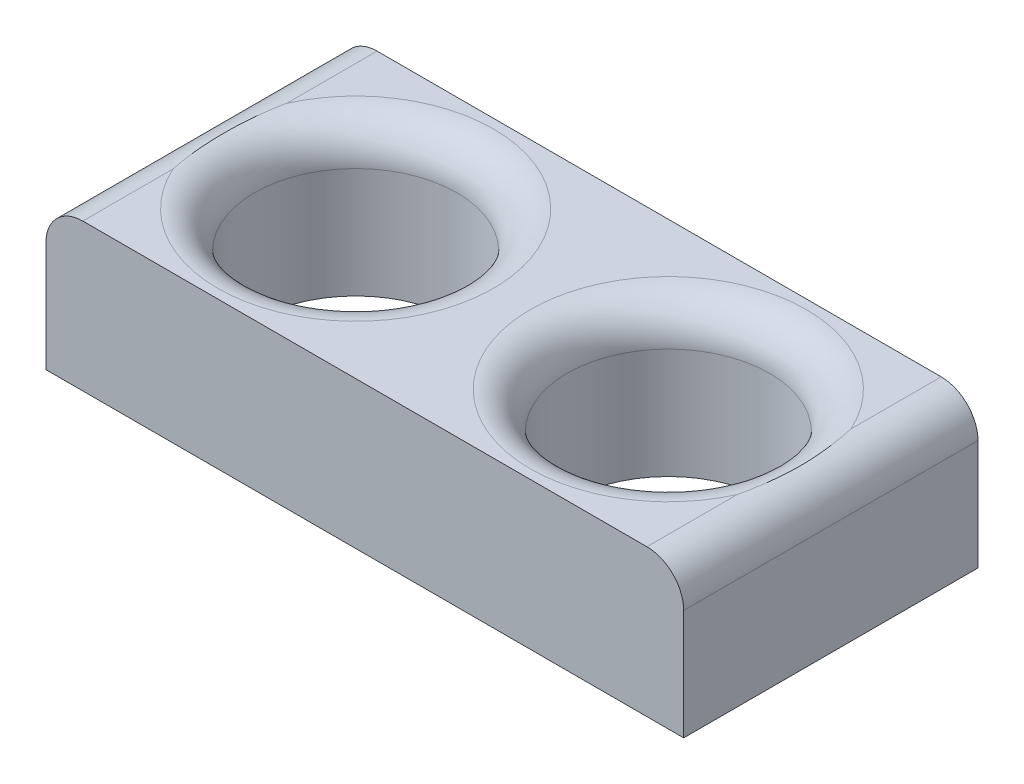
ISO-10303-21;
HEADER;
FILE_DESCRIPTION(('STEP AP214'),'2;1');
FILE_NAME('part.step','',(''),(''),'','','');
FILE_SCHEMA(('AUTOMOTIVE_DESIGN { 1 0 10303 214 1 1 1 1 }'));
ENDSEC;
DATA;
#1=APPLICATION_CONTEXT('core data for automotive mechanical design processes');
#2=APPLICATION_PROTOCOL_DEFINITION('international standard','automotive_design',2000,#1);
#3=PRODUCT_CONTEXT('',#1,'mechanical');
#4=PRODUCT('Part','Part','',(#3));
#5=PRODUCT_RELATED_PRODUCT_CATEGORY('part','',(#4));
#6=PRODUCT_DEFINITION_FORMATION('','',#4);
#7=PRODUCT_DEFINITION_CONTEXT('part definition',#1,'design');
#8=PRODUCT_DEFINITION('design','',#6,#7);
#9=PRODUCT_DEFINITION_SHAPE('','',#8);
#10=(LENGTH_UNIT() NAMED_UNIT(*) SI_UNIT(.MILLI.,.METRE.));
#11=(NAMED_UNIT(*) PLANE_ANGLE_UNIT() SI_UNIT($,.RADIAN.));
#12=(NAMED_UNIT(*) SI_UNIT($,.STERADIAN.) SOLID_ANGLE_UNIT());
#13=UNCERTAINTY_MEASURE_WITH_UNIT(LENGTH_MEASURE(1.E-05),#10,'distance_accuracy_value','');
#14=(GEOMETRIC_REPRESENTATION_CONTEXT(3) GLOBAL_UNCERTAINTY_ASSIGNED_CONTEXT((#13)) GLOBAL_UNIT_ASSIGNED_CONTEXT((#10,
#11,#12)) REPRESENTATION_CONTEXT('',''));
#15=CARTESIAN_POINT('',(0.,0.,0.));
#16=DIRECTION('',(0.,0.,1.));
#17=DIRECTION('',(1.,0.,0.));
#18=AXIS2_PLACEMENT_3D('',#15,#16,#17);
#19=CARTESIAN_POINT('',(26.,12.,-12.));
#20=DIRECTION('',(-1.,0.,0.));
#21=DIRECTION('',(0.,0.,1.));
#22=AXIS2_PLACEMENT_3D('',#19,#20,#21);
#23=PLANE('',#22);
#24=DIRECTION('',(0.,-1.,0.));
#25=VECTOR('',#24,1.);
#26=CARTESIAN_POINT('',(26.,12.,-12.));
#27=LINE('',#26,#25);
#28=CARTESIAN_POINT('',(26.,9.,-12.));
#29=VERTEX_POINT('',#28);
#30=CARTESIAN_POINT('',(26.,0.,-12.));
#31=VERTEX_POINT('',#30);
#32=EDGE_CURVE('E182',#29,#31,#27,.T.);
#33=ORIENTED_EDGE('',*,*,#32,.F.);
#34=DIRECTION('',(0.,0.,-1.));
#35=VECTOR('',#34,1.);
#36=CARTESIAN_POINT('',(26.,9.,12.));
#37=LINE('',#36,#35);
#38=CARTESIAN_POINT('',(26.,9.,12.));
#39=VERTEX_POINT('',#38);
#40=EDGE_CURVE('E68',#29,#39,#37,.F.);
#41=ORIENTED_EDGE('',*,*,#40,.T.);
#42=DIRECTION('',(0.,-1.,0.));
#43=VECTOR('',#42,1.);
#44=CARTESIAN_POINT('',(26.,12.,12.));
#45=LINE('',#44,#43);
#46=CARTESIAN_POINT('',(26.,0.,12.));
#47=VERTEX_POINT('',#46);
#48=EDGE_CURVE('E204',#39,#47,#45,.T.);
#49=ORIENTED_EDGE('',*,*,#48,.T.);
#50=DIRECTION('',(0.,0.,-1.));
#51=VECTOR('',#50,1.);
#52=CARTESIAN_POINT('',(26.,0.,-12.));
#53=LINE('',#52,#51);
#54=EDGE_CURVE('E199',#47,#31,#53,.T.);
#55=ORIENTED_EDGE('',*,*,#54,.T.);
#56=EDGE_LOOP('',(#33,#41,#49,#55));
#57=FACE_BOUND('',#56,.T.);
#58=ADVANCED_FACE('F38',(#57),#23,.F.);
#59=CARTESIAN_POINT('',(-26.,12.,-12.));
#60=DIRECTION('',(1.,0.,0.));
#61=DIRECTION('',(0.,0.,-1.));
#62=AXIS2_PLACEMENT_3D('',#59,#60,#61);
#63=PLANE('',#62);
#64=DIRECTION('',(0.,-1.,0.));
#65=VECTOR('',#64,1.);
#66=CARTESIAN_POINT('',(-26.,12.,12.));
#67=LINE('',#66,#65);
#68=CARTESIAN_POINT('',(-26.,9.,12.));
#69=VERTEX_POINT('',#68);
#70=CARTESIAN_POINT('',(-26.,0.,12.));
#71=VERTEX_POINT('',#70);
#72=EDGE_CURVE('E222',#69,#71,#67,.T.);
#73=ORIENTED_EDGE('',*,*,#72,.F.);
#74=DIRECTION('',(0.,0.,1.));
#75=VECTOR('',#74,1.);
#76=CARTESIAN_POINT('',(-26.,9.,-12.));
#77=LINE('',#76,#75);
#78=CARTESIAN_POINT('',(-26.,9.,-12.));
#79=VERTEX_POINT('',#78);
#80=EDGE_CURVE('E11',#69,#79,#77,.F.);
#81=ORIENTED_EDGE('',*,*,#80,.T.);
#82=DIRECTION('',(0.,-1.,0.));
#83=VECTOR('',#82,1.);
#84=CARTESIAN_POINT('',(-26.,12.,-12.));
#85=LINE('',#84,#83);
#86=CARTESIAN_POINT('',(-26.,0.,-12.));
#87=VERTEX_POINT('',#86);
#88=EDGE_CURVE('E192',#79,#87,#85,.T.);
#89=ORIENTED_EDGE('',*,*,#88,.T.);
#90=DIRECTION('',(0.,0.,1.));
#91=VECTOR('',#90,1.);
#92=CARTESIAN_POINT('',(-26.,0.,-12.));
#93=LINE('',#92,#91);
#94=EDGE_CURVE('E201',#87,#71,#93,.T.);
#95=ORIENTED_EDGE('',*,*,#94,.T.);
#96=EDGE_LOOP('',(#73,#81,#89,#95));
#97=FACE_BOUND('',#96,.T.);
#98=ADVANCED_FACE('F366',(#97),#63,.F.);
#99=CARTESIAN_POINT('',(0.,0.,0.));
#100=DIRECTION('',(0.,1.,0.));
#101=DIRECTION('',(0.,0.,1.));
#102=AXIS2_PLACEMENT_3D('',#99,#100,#101);
#103=PLANE('',#102);
#104=CARTESIAN_POINT('',(-12.75,0.,0.));
#105=DIRECTION('',(0.,1.,0.));
#106=DIRECTION('',(0.,0.,1.));
#107=AXIS2_PLACEMENT_3D('',#104,#105,#106);
#108=CIRCLE('',#107,8.25);
#109=CARTESIAN_POINT('',(-12.75,0.,8.25));
#110=VERTEX_POINT('',#109);
#111=EDGE_CURVE('E210',#110,#110,#108,.T.);
#112=ORIENTED_EDGE('',*,*,#111,.T.);
#113=EDGE_LOOP('',(#112));
#114=FACE_BOUND('',#113,.T.);
#115=CARTESIAN_POINT('',(12.75,0.,0.));
#116=DIRECTION('',(0.,1.,0.));
#117=DIRECTION('',(0.,0.,1.));
#118=AXIS2_PLACEMENT_3D('',#115,#116,#117);
#119=CIRCLE('',#118,8.25);
#120=CARTESIAN_POINT('',(12.75,0.,8.24999999999999));
#121=VERTEX_POINT('',#120);
#122=EDGE_CURVE('E206',#121,#121,#119,.T.);
#123=ORIENTED_EDGE('',*,*,#122,.T.);
#124=EDGE_LOOP('',(#123));
#125=FACE_BOUND('',#124,.T.);
#126=DIRECTION('',(0.,0.,1.));
#127=VECTOR('',#126,1.);
#128=CARTESIAN_POINT('',(6.,0.,0.));
#129=LINE('',#128,#127);
#130=CARTESIAN_POINT('',(6.,0.,-11.5));
#131=VERTEX_POINT('',#130);
#132=CARTESIAN_POINT('',(6.,0.,-5.5));
#133=VERTEX_POINT('',#132);
#134=EDGE_CURVE('E308',#131,#133,#129,.T.);
#135=ORIENTED_EDGE('',*,*,#134,.F.);
#136=CARTESIAN_POINT('',(6.5,0.,-11.5));
#137=DIRECTION('',(0.,1.,0.));
#138=DIRECTION('',(0.,0.,1.));
#139=AXIS2_PLACEMENT_3D('',#136,#137,#138);
#140=CIRCLE('',#139,0.5);
#141=CARTESIAN_POINT('',(6.5,0.,-12.));
#142=VERTEX_POINT('',#141);
#143=EDGE_CURVE('E200',#131,#142,#140,.F.);
#144=ORIENTED_EDGE('',*,*,#143,.T.);
#145=DIRECTION('',(-1.,0.,0.));
#146=VECTOR('',#145,1.);
#147=CARTESIAN_POINT('',(-26.,0.,-12.));
#148=LINE('',#147,#146);
#149=EDGE_CURVE('E186',#31,#142,#148,.T.);
#150=ORIENTED_EDGE('',*,*,#149,.F.);
#151=ORIENTED_EDGE('',*,*,#54,.F.);
#152=DIRECTION('',(1.,0.,0.));
#153=VECTOR('',#152,1.);
#154=CARTESIAN_POINT('',(-26.,0.,12.));
#155=LINE('',#154,#153);
#156=EDGE_CURVE('E218',#71,#47,#155,.T.);
#157=ORIENTED_EDGE('',*,*,#156,.F.);
#158=ORIENTED_EDGE('',*,*,#94,.F.);
#159=CARTESIAN_POINT('',(-6.5,0.,-12.));
#160=VERTEX_POINT('',#159);
#161=EDGE_CURVE('E202',#160,#87,#148,.T.);
#162=ORIENTED_EDGE('',*,*,#161,.F.);
#163=CARTESIAN_POINT('',(-6.5,0.,-11.5));
#164=DIRECTION('',(0.,1.,0.));
#165=DIRECTION('',(0.,0.,1.));
#166=AXIS2_PLACEMENT_3D('',#163,#164,#165);
#167=CIRCLE('',#166,0.5);
#168=CARTESIAN_POINT('',(-6.,0.,-11.5));
#169=VERTEX_POINT('',#168);
#170=EDGE_CURVE('E231',#160,#169,#167,.F.);
#171=ORIENTED_EDGE('',*,*,#170,.T.);
#172=DIRECTION('',(0.,0.,1.));
#173=VECTOR('',#172,1.);
#174=CARTESIAN_POINT('',(-6.,0.,0.));
#175=LINE('',#174,#173);
#176=CARTESIAN_POINT('',(-6.,0.,-5.5));
#177=VERTEX_POINT('',#176);
#178=EDGE_CURVE('E451',#169,#177,#175,.T.);
#179=ORIENTED_EDGE('',*,*,#178,.T.);
#180=CARTESIAN_POINT('',(-5.5,0.,-5.5));
#181=DIRECTION('',(0.,1.,0.));
#182=DIRECTION('',(0.,0.,1.));
#183=AXIS2_PLACEMENT_3D('',#180,#181,#182);
#184=CIRCLE('',#183,0.5);
#185=CARTESIAN_POINT('',(-5.5,0.,-5.));
#186=VERTEX_POINT('',#185);
#187=EDGE_CURVE('E269',#177,#186,#184,.T.);
#188=ORIENTED_EDGE('',*,*,#187,.T.);
#189=DIRECTION('',(1.,0.,0.));
#190=VECTOR('',#189,1.);
#191=CARTESIAN_POINT('',(0.,0.,-5.));
#192=LINE('',#191,#190);
#193=CARTESIAN_POINT('',(5.5,0.,-5.));
#194=VERTEX_POINT('',#193);
#195=EDGE_CURVE('E447',#186,#194,#192,.T.);
#196=ORIENTED_EDGE('',*,*,#195,.T.);
#197=CARTESIAN_POINT('',(5.5,0.,-5.5));
#198=DIRECTION('',(0.,1.,0.));
#199=DIRECTION('',(0.,0.,1.));
#200=AXIS2_PLACEMENT_3D('',#197,#198,#199);
#201=CIRCLE('',#200,0.5);
#202=EDGE_CURVE('E267',#194,#133,#201,.T.);
#203=ORIENTED_EDGE('',*,*,#202,.T.);
#204=EDGE_LOOP('',(#135,#144,#150,#151,#157,#158,#162,#171,#179,#188,#196,#203));
#205=FACE_BOUND('',#204,.T.);
#206=ADVANCED_FACE('F197',(#114,#125,#205),#103,.F.);
#207=CARTESIAN_POINT('',(-26.,12.,-12.));
#208=DIRECTION('',(0.,0.,1.));
#209=DIRECTION('',(1.,0.,0.));
#210=AXIS2_PLACEMENT_3D('',#207,#208,#209);
#211=PLANE('',#210);
#212=DIRECTION('',(-1.,0.,0.));
#213=VECTOR('',#212,1.);
#214=CARTESIAN_POINT('',(-26.,12.,-12.));
#215=LINE('',#214,#213);
#216=CARTESIAN_POINT('',(23.,12.,-12.));
#217=VERTEX_POINT('',#216);
#218=CARTESIAN_POINT('',(-23.,12.,-12.));
#219=VERTEX_POINT('',#218);
#220=EDGE_CURVE('E220',#217,#219,#215,.T.);
#221=ORIENTED_EDGE('',*,*,#220,.F.);
#222=CARTESIAN_POINT('',(23.,9.,-12.));
#223=DIRECTION('',(0.,0.,1.));
#224=DIRECTION('',(1.,0.,0.));
#225=AXIS2_PLACEMENT_3D('',#222,#223,#224);
#226=CIRCLE('',#225,3.);
#227=EDGE_CURVE('E189',#217,#29,#226,.F.);
#228=ORIENTED_EDGE('',*,*,#227,.T.);
#229=ORIENTED_EDGE('',*,*,#32,.T.);
#230=ORIENTED_EDGE('',*,*,#149,.T.);
#231=DIRECTION('',(0.,-1.,0.));
#232=VECTOR('',#231,1.);
#233=CARTESIAN_POINT('',(6.5,12.,-12.));
#234=LINE('',#233,#232);
#235=CARTESIAN_POINT('',(6.5,4.5,-12.));
#236=VERTEX_POINT('',#235);
#237=EDGE_CURVE('E244',#142,#236,#234,.F.);
#238=ORIENTED_EDGE('',*,*,#237,.T.);
#239=CARTESIAN_POINT('',(5.5,4.5,-12.));
#240=DIRECTION('',(0.,0.,1.));
#241=DIRECTION('',(1.,0.,0.));
#242=AXIS2_PLACEMENT_3D('',#239,#240,#241);
#243=CIRCLE('',#242,1.);
#244=CARTESIAN_POINT('',(5.5,5.5,-12.));
#245=VERTEX_POINT('',#244);
#246=EDGE_CURVE('E241',#245,#236,#243,.F.);
#247=ORIENTED_EDGE('',*,*,#246,.F.);
#248=DIRECTION('',(1.,0.,0.));
#249=VECTOR('',#248,1.);
#250=CARTESIAN_POINT('',(-6.,5.5,-12.));
#251=LINE('',#250,#249);
#252=CARTESIAN_POINT('',(-5.5,5.5,-12.));
#253=VERTEX_POINT('',#252);
#254=EDGE_CURVE('E239',#245,#253,#251,.F.);
#255=ORIENTED_EDGE('',*,*,#254,.T.);
#256=CARTESIAN_POINT('',(-5.5,4.5,-12.));
#257=DIRECTION('',(0.,0.,1.));
#258=DIRECTION('',(1.,0.,0.));
#259=AXIS2_PLACEMENT_3D('',#256,#257,#258);
#260=CIRCLE('',#259,1.);
#261=CARTESIAN_POINT('',(-6.5,4.5,-12.));
#262=VERTEX_POINT('',#261);
#263=EDGE_CURVE('E236',#262,#253,#260,.F.);
#264=ORIENTED_EDGE('',*,*,#263,.F.);
#265=DIRECTION('',(0.,-1.,0.));
#266=VECTOR('',#265,1.);
#267=CARTESIAN_POINT('',(-6.5,0.,-12.));
#268=LINE('',#267,#266);
#269=EDGE_CURVE('E234',#262,#160,#268,.T.);
#270=ORIENTED_EDGE('',*,*,#269,.T.);
#271=ORIENTED_EDGE('',*,*,#161,.T.);
#272=ORIENTED_EDGE('',*,*,#88,.F.);
#273=CARTESIAN_POINT('',(-23.,9.,-12.));
#274=DIRECTION('',(0.,0.,1.));
#275=DIRECTION('',(1.,0.,0.));
#276=AXIS2_PLACEMENT_3D('',#273,#274,#275);
#277=CIRCLE('',#276,3.);
#278=EDGE_CURVE('E332',#79,#219,#277,.F.);
#279=ORIENTED_EDGE('',*,*,#278,.T.);
#280=EDGE_LOOP('',(#221,#228,#229,#230,#238,#247,#255,#264,#270,#271,#272,#279));
#281=FACE_BOUND('',#280,.T.);
#282=ADVANCED_FACE('F185',(#281),#211,.F.);
#283=CARTESIAN_POINT('',(0.,12.,0.));
#284=DIRECTION('',(0.,1.,0.));
#285=DIRECTION('',(0.,0.,1.));
#286=AXIS2_PLACEMENT_3D('',#283,#284,#285);
#287=PLANE('',#286);
#288=DIRECTION('',(1.,0.,0.));
#289=VECTOR('',#288,1.);
#290=CARTESIAN_POINT('',(-26.,12.,12.));
#291=LINE('',#290,#289);
#292=CARTESIAN_POINT('',(-23.,12.,12.));
#293=VERTEX_POINT('',#292);
#294=CARTESIAN_POINT('',(23.,12.,12.));
#295=VERTEX_POINT('',#294);
#296=EDGE_CURVE('E213',#293,#295,#291,.T.);
#297=ORIENTED_EDGE('',*,*,#296,.T.);
#298=DIRECTION('',(0.,0.,-1.));
#299=VECTOR('',#298,1.);
#300=CARTESIAN_POINT('',(23.,12.,-12.));
#301=LINE('',#300,#299);
#302=CARTESIAN_POINT('',(23.,12.,4.63680924774784));
#303=VERTEX_POINT('',#302);
#304=EDGE_CURVE('E327',#295,#303,#301,.T.);
#305=ORIENTED_EDGE('',*,*,#304,.T.);
#306=CARTESIAN_POINT('',(12.75,12.,0.));
#307=DIRECTION('',(0.,1.,0.));
#308=DIRECTION('',(0.,0.,1.));
#309=AXIS2_PLACEMENT_3D('',#306,#307,#308);
#310=CIRCLE('',#309,11.25);
#311=CARTESIAN_POINT('',(12.75,12.,11.25));
#312=VERTEX_POINT('',#311);
#313=EDGE_CURVE('E324',#303,#312,#310,.F.);
#314=ORIENTED_EDGE('',*,*,#313,.T.);
#315=CARTESIAN_POINT('',(12.75,12.,0.));
#316=DIRECTION('',(0.,1.,0.));
#317=DIRECTION('',(0.,0.,1.));
#318=AXIS2_PLACEMENT_3D('',#315,#316,#317);
#319=CIRCLE('',#318,11.25);
#320=CARTESIAN_POINT('',(23.,12.,-4.63680924774784));
#321=VERTEX_POINT('',#320);
#322=EDGE_CURVE('E322',#312,#321,#319,.F.);
#323=ORIENTED_EDGE('',*,*,#322,.T.);
#324=DIRECTION('',(0.,0.,-1.));
#325=VECTOR('',#324,1.);
#326=CARTESIAN_POINT('',(23.,12.,-12.));
#327=LINE('',#326,#325);
#328=EDGE_CURVE('E320',#321,#217,#327,.T.);
#329=ORIENTED_EDGE('',*,*,#328,.T.);
#330=ORIENTED_EDGE('',*,*,#220,.T.);
#331=DIRECTION('',(0.,0.,1.));
#332=VECTOR('',#331,1.);
#333=CARTESIAN_POINT('',(-23.,12.,12.));
#334=LINE('',#333,#332);
#335=CARTESIAN_POINT('',(-23.,12.,-4.63680924774785));
#336=VERTEX_POINT('',#335);
#337=EDGE_CURVE('E318',#219,#336,#334,.T.);
#338=ORIENTED_EDGE('',*,*,#337,.T.);
#339=CARTESIAN_POINT('',(-12.75,12.,0.));
#340=DIRECTION('',(0.,1.,0.));
#341=DIRECTION('',(0.,0.,1.));
#342=AXIS2_PLACEMENT_3D('',#339,#340,#341);
#343=CIRCLE('',#342,11.25);
#344=CARTESIAN_POINT('',(-12.75,12.,11.25));
#345=VERTEX_POINT('',#344);
#346=EDGE_CURVE('E315',#336,#345,#343,.F.);
#347=ORIENTED_EDGE('',*,*,#346,.T.);
#348=CARTESIAN_POINT('',(-12.75,12.,0.));
#349=DIRECTION('',(0.,1.,0.));
#350=DIRECTION('',(0.,0.,1.));
#351=AXIS2_PLACEMENT_3D('',#348,#349,#350);
#352=CIRCLE('',#351,11.25);
#353=CARTESIAN_POINT('',(-23.,12.,4.63680924774786));
#354=VERTEX_POINT('',#353);
#355=EDGE_CURVE('E313',#345,#354,#352,.F.);
#356=ORIENTED_EDGE('',*,*,#355,.T.);
#357=DIRECTION('',(0.,0.,1.));
#358=VECTOR('',#357,1.);
#359=CARTESIAN_POINT('',(-23.,12.,12.));
#360=LINE('',#359,#358);
#361=EDGE_CURVE('E311',#354,#293,#360,.T.);
#362=ORIENTED_EDGE('',*,*,#361,.T.);
#363=EDGE_LOOP('',(#297,#305,#314,#323,#329,#330,#338,#347,#356,#362));
#364=FACE_BOUND('',#363,.T.);
#365=ADVANCED_FACE('F462',(#364),#287,.T.);
#366=CARTESIAN_POINT('',(-26.,12.,12.));
#367=DIRECTION('',(0.,0.,-1.));
#368=DIRECTION('',(-1.,0.,0.));
#369=AXIS2_PLACEMENT_3D('',#366,#367,#368);
#370=PLANE('',#369);
#371=ORIENTED_EDGE('',*,*,#48,.F.);
#372=CARTESIAN_POINT('',(23.,9.,12.));
#373=DIRECTION('',(0.,0.,-1.));
#374=DIRECTION('',(-1.,0.,0.));
#375=AXIS2_PLACEMENT_3D('',#372,#373,#374);
#376=CIRCLE('',#375,3.);
#377=EDGE_CURVE('E52',#39,#295,#376,.F.);
#378=ORIENTED_EDGE('',*,*,#377,.T.);
#379=ORIENTED_EDGE('',*,*,#296,.F.);
#380=CARTESIAN_POINT('',(-23.,9.,12.));
#381=DIRECTION('',(0.,0.,-1.));
#382=DIRECTION('',(-1.,0.,0.));
#383=AXIS2_PLACEMENT_3D('',#380,#381,#382);
#384=CIRCLE('',#383,3.);
#385=EDGE_CURVE('E60',#293,#69,#384,.F.);
#386=ORIENTED_EDGE('',*,*,#385,.T.);
#387=ORIENTED_EDGE('',*,*,#72,.T.);
#388=ORIENTED_EDGE('',*,*,#156,.T.);
#389=EDGE_LOOP('',(#371,#378,#379,#386,#387,#388));
#390=FACE_BOUND('',#389,.T.);
#391=ADVANCED_FACE('F491',(#390),#370,.F.);
#392=CARTESIAN_POINT('',(12.75,12.,0.));
#393=DIRECTION('',(0.,-1.,0.));
#394=DIRECTION('',(0.,0.,-1.));
#395=AXIS2_PLACEMENT_3D('',#392,#393,#394);
#396=CYLINDRICAL_SURFACE('',#395,8.25);
#397=CARTESIAN_POINT('',(12.75,9.,0.));
#398=DIRECTION('',(0.,1.,0.));
#399=DIRECTION('',(0.,0.,1.));
#400=AXIS2_PLACEMENT_3D('',#397,#398,#399);
#401=CIRCLE('',#400,8.25);
#402=CARTESIAN_POINT('',(12.75,9.,8.24999999999999));
#403=VERTEX_POINT('',#402);
#404=EDGE_CURVE('E271',#403,#403,#401,.T.);
#405=ORIENTED_EDGE('',*,*,#404,.T.);
#406=EDGE_LOOP('',(#405));
#407=FACE_BOUND('',#406,.T.);
#408=ORIENTED_EDGE('',*,*,#122,.F.);
#409=EDGE_LOOP('',(#408));
#410=FACE_BOUND('',#409,.T.);
#411=ADVANCED_FACE('F481',(#407,#410),#396,.F.);
#412=CARTESIAN_POINT('',(-12.75,12.,0.));
#413=DIRECTION('',(0.,-1.,0.));
#414=DIRECTION('',(0.,0.,-1.));
#415=AXIS2_PLACEMENT_3D('',#412,#413,#414);
#416=CYLINDRICAL_SURFACE('',#415,8.25);
#417=CARTESIAN_POINT('',(-12.75,9.,0.));
#418=DIRECTION('',(0.,1.,0.));
#419=DIRECTION('',(0.,0.,1.));
#420=AXIS2_PLACEMENT_3D('',#417,#418,#419);
#421=CIRCLE('',#420,8.25);
#422=CARTESIAN_POINT('',(-12.75,9.,8.25));
#423=VERTEX_POINT('',#422);
#424=EDGE_CURVE('E329',#423,#423,#421,.T.);
#425=ORIENTED_EDGE('',*,*,#424,.T.);
#426=EDGE_LOOP('',(#425));
#427=FACE_BOUND('',#426,.T.);
#428=ORIENTED_EDGE('',*,*,#111,.F.);
#429=EDGE_LOOP('',(#428));
#430=FACE_BOUND('',#429,.T.);
#431=ADVANCED_FACE('F477',(#427,#430),#416,.F.);
#432=CARTESIAN_POINT('',(-6.,5.,0.));
#433=DIRECTION('',(1.,0.,0.));
#434=DIRECTION('',(0.,0.,-1.));
#435=AXIS2_PLACEMENT_3D('',#432,#433,#434);
#436=PLANE('',#435);
#437=ORIENTED_EDGE('',*,*,#178,.F.);
#438=DIRECTION('',(0.,-1.,0.));
#439=VECTOR('',#438,1.);
#440=CARTESIAN_POINT('',(-6.,5.,-11.5));
#441=LINE('',#440,#439);
#442=CARTESIAN_POINT('',(-6.,4.5,-11.5));
#443=VERTEX_POINT('',#442);
#444=EDGE_CURVE('E259',#169,#443,#441,.F.);
#445=ORIENTED_EDGE('',*,*,#444,.T.);
#446=DIRECTION('',(0.,0.,1.));
#447=VECTOR('',#446,1.);
#448=CARTESIAN_POINT('',(-6.,4.5,-5.));
#449=LINE('',#448,#447);
#450=CARTESIAN_POINT('',(-6.,4.5,-5.5));
#451=VERTEX_POINT('',#450);
#452=EDGE_CURVE('E257',#443,#451,#449,.T.);
#453=ORIENTED_EDGE('',*,*,#452,.T.);
#454=DIRECTION('',(0.,-1.,0.));
#455=VECTOR('',#454,1.);
#456=CARTESIAN_POINT('',(-6.,0.,-5.5));
#457=LINE('',#456,#455);
#458=EDGE_CURVE('E255',#451,#177,#457,.T.);
#459=ORIENTED_EDGE('',*,*,#458,.T.);
#460=EDGE_LOOP('',(#437,#445,#453,#459));
#461=FACE_BOUND('',#460,.T.);
#462=ADVANCED_FACE('F480',(#461),#436,.T.);
#463=CARTESIAN_POINT('',(0.,5.,-5.));
#464=DIRECTION('',(0.,0.,-1.));
#465=DIRECTION('',(-1.,0.,0.));
#466=AXIS2_PLACEMENT_3D('',#463,#464,#465);
#467=PLANE('',#466);
#468=DIRECTION('',(1.,0.,0.));
#469=VECTOR('',#468,1.);
#470=CARTESIAN_POINT('',(6.,4.5,-5.));
#471=LINE('',#470,#469);
#472=CARTESIAN_POINT('',(-5.5,4.5,-5.));
#473=VERTEX_POINT('',#472);
#474=CARTESIAN_POINT('',(5.5,4.5,-5.));
#475=VERTEX_POINT('',#474);
#476=EDGE_CURVE('E263',#473,#475,#471,.T.);
#477=ORIENTED_EDGE('',*,*,#476,.T.);
#478=DIRECTION('',(0.,-1.,0.));
#479=VECTOR('',#478,1.);
#480=CARTESIAN_POINT('',(5.5,5.,-5.));
#481=LINE('',#480,#479);
#482=EDGE_CURVE('E265',#475,#194,#481,.T.);
#483=ORIENTED_EDGE('',*,*,#482,.T.);
#484=ORIENTED_EDGE('',*,*,#195,.F.);
#485=DIRECTION('',(0.,-1.,0.));
#486=VECTOR('',#485,1.);
#487=CARTESIAN_POINT('',(-5.5,5.,-5.));
#488=LINE('',#487,#486);
#489=EDGE_CURVE('E261',#186,#473,#488,.F.);
#490=ORIENTED_EDGE('',*,*,#489,.T.);
#491=EDGE_LOOP('',(#477,#483,#484,#490));
#492=FACE_BOUND('',#491,.T.);
#493=ADVANCED_FACE('F439',(#492),#467,.T.);
#494=CARTESIAN_POINT('',(6.,5.,0.));
#495=DIRECTION('',(1.,0.,0.));
#496=DIRECTION('',(0.,0.,-1.));
#497=AXIS2_PLACEMENT_3D('',#494,#495,#496);
#498=PLANE('',#497);
#499=DIRECTION('',(0.,0.,1.));
#500=VECTOR('',#499,1.);
#501=CARTESIAN_POINT('',(6.,4.5,0.));
#502=LINE('',#501,#500);
#503=CARTESIAN_POINT('',(6.,4.5,-5.5));
#504=VERTEX_POINT('',#503);
#505=CARTESIAN_POINT('',(6.,4.5,-11.5));
#506=VERTEX_POINT('',#505);
#507=EDGE_CURVE('E226',#504,#506,#502,.F.);
#508=ORIENTED_EDGE('',*,*,#507,.T.);
#509=DIRECTION('',(0.,-1.,0.));
#510=VECTOR('',#509,1.);
#511=CARTESIAN_POINT('',(6.,5.,-11.5));
#512=LINE('',#511,#510);
#513=EDGE_CURVE('E228',#506,#131,#512,.T.);
#514=ORIENTED_EDGE('',*,*,#513,.T.);
#515=ORIENTED_EDGE('',*,*,#134,.T.);
#516=DIRECTION('',(0.,-1.,0.));
#517=VECTOR('',#516,1.);
#518=CARTESIAN_POINT('',(6.,5.,-5.5));
#519=LINE('',#518,#517);
#520=EDGE_CURVE('E191',#133,#504,#519,.F.);
#521=ORIENTED_EDGE('',*,*,#520,.T.);
#522=EDGE_LOOP('',(#508,#514,#515,#521));
#523=FACE_BOUND('',#522,.T.);
#524=ADVANCED_FACE('F424',(#523),#498,.F.);
#525=CARTESIAN_POINT('',(0.,5.,0.));
#526=DIRECTION('',(0.,-1.,0.));
#527=DIRECTION('',(0.,0.,-1.));
#528=AXIS2_PLACEMENT_3D('',#525,#526,#527);
#529=PLANE('',#528);
#530=DIRECTION('',(0.,0.,1.));
#531=VECTOR('',#530,1.);
#532=CARTESIAN_POINT('',(-5.5,5.,-12.));
#533=LINE('',#532,#531);
#534=CARTESIAN_POINT('',(-5.5,5.,-5.5));
#535=VERTEX_POINT('',#534);
#536=CARTESIAN_POINT('',(-5.5,5.,-11.5));
#537=VERTEX_POINT('',#536);
#538=EDGE_CURVE('E250',#535,#537,#533,.F.);
#539=ORIENTED_EDGE('',*,*,#538,.T.);
#540=DIRECTION('',(1.,0.,0.));
#541=VECTOR('',#540,1.);
#542=CARTESIAN_POINT('',(6.,5.,-11.5));
#543=LINE('',#542,#541);
#544=CARTESIAN_POINT('',(5.5,5.,-11.5));
#545=VERTEX_POINT('',#544);
#546=EDGE_CURVE('E252',#537,#545,#543,.T.);
#547=ORIENTED_EDGE('',*,*,#546,.T.);
#548=DIRECTION('',(0.,0.,1.));
#549=VECTOR('',#548,1.);
#550=CARTESIAN_POINT('',(5.5,5.,0.));
#551=LINE('',#550,#549);
#552=CARTESIAN_POINT('',(5.5,5.,-5.5));
#553=VERTEX_POINT('',#552);
#554=EDGE_CURVE('E248',#545,#553,#551,.T.);
#555=ORIENTED_EDGE('',*,*,#554,.T.);
#556=DIRECTION('',(1.,0.,0.));
#557=VECTOR('',#556,1.);
#558=CARTESIAN_POINT('',(-6.,5.,-5.5));
#559=LINE('',#558,#557);
#560=EDGE_CURVE('E246',#553,#535,#559,.F.);
#561=ORIENTED_EDGE('',*,*,#560,.T.);
#562=EDGE_LOOP('',(#539,#547,#555,#561));
#563=FACE_BOUND('',#562,.T.);
#564=ADVANCED_FACE('F419',(#563),#529,.T.);
#565=CARTESIAN_POINT('',(-5.5,5.,-5.5));
#566=DIRECTION('',(0.,1.,0.));
#567=DIRECTION('',(0.,0.,1.));
#568=AXIS2_PLACEMENT_3D('',#565,#566,#567);
#569=CYLINDRICAL_SURFACE('',#568,0.5);
#570=CARTESIAN_POINT('',(-5.5,4.5,-5.5));
#571=DIRECTION('',(0.,-1.,0.));
#572=DIRECTION('',(0.,0.,-1.));
#573=AXIS2_PLACEMENT_3D('',#570,#571,#572);
#574=CIRCLE('',#573,0.5);
#575=EDGE_CURVE('E305',#473,#451,#574,.T.);
#576=ORIENTED_EDGE('',*,*,#575,.F.);
#577=ORIENTED_EDGE('',*,*,#489,.F.);
#578=ORIENTED_EDGE('',*,*,#187,.F.);
#579=ORIENTED_EDGE('',*,*,#458,.F.);
#580=EDGE_LOOP('',(#576,#577,#578,#579));
#581=FACE_BOUND('',#580,.T.);
#582=ADVANCED_FACE('F416',(#581),#569,.F.);
#583=CARTESIAN_POINT('',(-5.5,4.5,-5.5));
#584=DIRECTION('',(0.,0.,1.));
#585=DIRECTION('',(1.,0.,0.));
#586=AXIS2_PLACEMENT_3D('',#583,#584,#585);
#587=SPHERICAL_SURFACE('',#586,0.5);
#588=CARTESIAN_POINT('',(-5.5,4.5,-5.5));
#589=DIRECTION('',(1.,0.,0.));
#590=DIRECTION('',(0.,0.,-1.));
#591=AXIS2_PLACEMENT_3D('',#588,#589,#590);
#592=CIRCLE('',#591,0.5);
#593=EDGE_CURVE('E299',#473,#535,#592,.F.);
#594=ORIENTED_EDGE('',*,*,#593,.F.);
#595=ORIENTED_EDGE('',*,*,#575,.T.);
#596=CARTESIAN_POINT('',(-5.5,4.5,-5.5));
#597=DIRECTION('',(0.,0.,-1.));
#598=DIRECTION('',(-1.,0.,0.));
#599=AXIS2_PLACEMENT_3D('',#596,#597,#598);
#600=CIRCLE('',#599,0.5);
#601=EDGE_CURVE('E302',#535,#451,#600,.F.);
#602=ORIENTED_EDGE('',*,*,#601,.F.);
#603=EDGE_LOOP('',(#594,#595,#602));
#604=FACE_BOUND('',#603,.T.);
#605=ADVANCED_FACE('F413',(#604),#587,.F.);
#606=CARTESIAN_POINT('',(-6.5,12.,-11.5));
#607=DIRECTION('',(0.,1.,0.));
#608=DIRECTION('',(0.,0.,1.));
#609=AXIS2_PLACEMENT_3D('',#606,#607,#608);
#610=CYLINDRICAL_SURFACE('',#609,0.5);
#611=ORIENTED_EDGE('',*,*,#170,.F.);
#612=ORIENTED_EDGE('',*,*,#269,.F.);
#613=CARTESIAN_POINT('',(-6.5,4.5,-11.5));
#614=DIRECTION('',(0.,1.,0.));
#615=DIRECTION('',(0.,0.,1.));
#616=AXIS2_PLACEMENT_3D('',#613,#614,#615);
#617=CIRCLE('',#616,0.5);
#618=EDGE_CURVE('E296',#443,#262,#617,.T.);
#619=ORIENTED_EDGE('',*,*,#618,.F.);
#620=ORIENTED_EDGE('',*,*,#444,.F.);
#621=EDGE_LOOP('',(#611,#612,#619,#620));
#622=FACE_BOUND('',#621,.T.);
#623=ADVANCED_FACE('F409',(#622),#610,.T.);
#624=CARTESIAN_POINT('',(-5.5,4.5,0.));
#625=DIRECTION('',(0.,0.,-1.));
#626=DIRECTION('',(-1.,0.,0.));
#627=AXIS2_PLACEMENT_3D('',#624,#625,#626);
#628=CYLINDRICAL_SURFACE('',#627,0.5);
#629=ORIENTED_EDGE('',*,*,#601,.T.);
#630=ORIENTED_EDGE('',*,*,#452,.F.);
#631=CARTESIAN_POINT('',(-5.5,4.5,-11.5));
#632=DIRECTION('',(0.,0.,1.));
#633=DIRECTION('',(1.,0.,0.));
#634=AXIS2_PLACEMENT_3D('',#631,#632,#633);
#635=CIRCLE('',#634,0.5);
#636=EDGE_CURVE('E293',#537,#443,#635,.T.);
#637=ORIENTED_EDGE('',*,*,#636,.F.);
#638=ORIENTED_EDGE('',*,*,#538,.F.);
#639=EDGE_LOOP('',(#629,#630,#637,#638));
#640=FACE_BOUND('',#639,.T.);
#641=ADVANCED_FACE('F405',(#640),#628,.F.);
#642=CARTESIAN_POINT('',(0.,4.5,-5.5));
#643=DIRECTION('',(-1.,0.,0.));
#644=DIRECTION('',(0.,0.,1.));
#645=AXIS2_PLACEMENT_3D('',#642,#643,#644);
#646=CYLINDRICAL_SURFACE('',#645,0.5);
#647=ORIENTED_EDGE('',*,*,#593,.T.);
#648=ORIENTED_EDGE('',*,*,#560,.F.);
#649=CARTESIAN_POINT('',(5.5,4.5,-5.5));
#650=DIRECTION('',(-1.,0.,0.));
#651=DIRECTION('',(0.,0.,1.));
#652=AXIS2_PLACEMENT_3D('',#649,#650,#651);
#653=CIRCLE('',#652,0.5);
#654=EDGE_CURVE('E290',#475,#553,#653,.T.);
#655=ORIENTED_EDGE('',*,*,#654,.F.);
#656=ORIENTED_EDGE('',*,*,#476,.F.);
#657=EDGE_LOOP('',(#647,#648,#655,#656));
#658=FACE_BOUND('',#657,.T.);
#659=ADVANCED_FACE('F401',(#658),#646,.F.);
#660=CARTESIAN_POINT('',(5.5,5.,-5.5));
#661=DIRECTION('',(0.,-1.,0.));
#662=DIRECTION('',(0.,0.,-1.));
#663=AXIS2_PLACEMENT_3D('',#660,#661,#662);
#664=CYLINDRICAL_SURFACE('',#663,0.5);
#665=ORIENTED_EDGE('',*,*,#202,.F.);
#666=ORIENTED_EDGE('',*,*,#482,.F.);
#667=CARTESIAN_POINT('',(5.5,4.5,-5.5));
#668=DIRECTION('',(0.,-1.,0.));
#669=DIRECTION('',(0.,0.,-1.));
#670=AXIS2_PLACEMENT_3D('',#667,#668,#669);
#671=CIRCLE('',#670,0.5);
#672=EDGE_CURVE('E287',#504,#475,#671,.T.);
#673=ORIENTED_EDGE('',*,*,#672,.F.);
#674=ORIENTED_EDGE('',*,*,#520,.F.);
#675=EDGE_LOOP('',(#665,#666,#673,#674));
#676=FACE_BOUND('',#675,.T.);
#677=ADVANCED_FACE('F397',(#676),#664,.F.);
#678=CARTESIAN_POINT('',(-5.5,4.5,-11.5));
#679=DIRECTION('',(0.,0.,1.));
#680=DIRECTION('',(1.,0.,0.));
#681=AXIS2_PLACEMENT_3D('',#678,#679,#680);
#682=TOROIDAL_SURFACE('',#681,1.,0.5);
#683=ORIENTED_EDGE('',*,*,#618,.T.);
#684=ORIENTED_EDGE('',*,*,#263,.T.);
#685=CARTESIAN_POINT('',(-5.5,5.5,-11.5));
#686=DIRECTION('',(-1.,0.,0.));
#687=DIRECTION('',(0.,0.,1.));
#688=AXIS2_PLACEMENT_3D('',#685,#686,#687);
#689=CIRCLE('',#688,0.5);
#690=EDGE_CURVE('E284',#537,#253,#689,.F.);
#691=ORIENTED_EDGE('',*,*,#690,.F.);
#692=ORIENTED_EDGE('',*,*,#636,.T.);
#693=EDGE_LOOP('',(#683,#684,#691,#692));
#694=FACE_BOUND('',#693,.T.);
#695=ADVANCED_FACE('F393',(#694),#682,.T.);
#696=CARTESIAN_POINT('',(5.5,4.5,-5.5));
#697=DIRECTION('',(0.,0.,1.));
#698=DIRECTION('',(1.,0.,0.));
#699=AXIS2_PLACEMENT_3D('',#696,#697,#698);
#700=SPHERICAL_SURFACE('',#699,0.5);
#701=ORIENTED_EDGE('',*,*,#672,.T.);
#702=ORIENTED_EDGE('',*,*,#654,.T.);
#703=CARTESIAN_POINT('',(5.5,4.5,-5.5));
#704=DIRECTION('',(0.,0.,-1.));
#705=DIRECTION('',(-1.,0.,0.));
#706=AXIS2_PLACEMENT_3D('',#703,#704,#705);
#707=CIRCLE('',#706,0.5);
#708=EDGE_CURVE('E281',#504,#553,#707,.F.);
#709=ORIENTED_EDGE('',*,*,#708,.F.);
#710=EDGE_LOOP('',(#701,#702,#709));
#711=FACE_BOUND('',#710,.T.);
#712=ADVANCED_FACE('F389',(#711),#700,.F.);
#713=CARTESIAN_POINT('',(0.,5.5,-11.5));
#714=DIRECTION('',(-1.,0.,0.));
#715=DIRECTION('',(0.,0.,1.));
#716=AXIS2_PLACEMENT_3D('',#713,#714,#715);
#717=CYLINDRICAL_SURFACE('',#716,0.5);
#718=ORIENTED_EDGE('',*,*,#690,.T.);
#719=ORIENTED_EDGE('',*,*,#254,.F.);
#720=CARTESIAN_POINT('',(5.5,5.5,-11.5));
#721=DIRECTION('',(1.,0.,0.));
#722=DIRECTION('',(0.,0.,-1.));
#723=AXIS2_PLACEMENT_3D('',#720,#721,#722);
#724=CIRCLE('',#723,0.5);
#725=EDGE_CURVE('E278',#545,#245,#724,.T.);
#726=ORIENTED_EDGE('',*,*,#725,.F.);
#727=ORIENTED_EDGE('',*,*,#546,.F.);
#728=EDGE_LOOP('',(#718,#719,#726,#727));
#729=FACE_BOUND('',#728,.T.);
#730=ADVANCED_FACE('F385',(#729),#717,.T.);
#731=CARTESIAN_POINT('',(5.5,4.5,0.));
#732=DIRECTION('',(0.,0.,1.));
#733=DIRECTION('',(1.,0.,0.));
#734=AXIS2_PLACEMENT_3D('',#731,#732,#733);
#735=CYLINDRICAL_SURFACE('',#734,0.5);
#736=ORIENTED_EDGE('',*,*,#708,.T.);
#737=ORIENTED_EDGE('',*,*,#554,.F.);
#738=CARTESIAN_POINT('',(5.5,4.5,-11.5));
#739=DIRECTION('',(0.,0.,1.));
#740=DIRECTION('',(1.,0.,0.));
#741=AXIS2_PLACEMENT_3D('',#738,#739,#740);
#742=CIRCLE('',#741,0.5);
#743=EDGE_CURVE('E275',#506,#545,#742,.T.);
#744=ORIENTED_EDGE('',*,*,#743,.F.);
#745=ORIENTED_EDGE('',*,*,#507,.F.);
#746=EDGE_LOOP('',(#736,#737,#744,#745));
#747=FACE_BOUND('',#746,.T.);
#748=ADVANCED_FACE('F381',(#747),#735,.F.);
#749=CARTESIAN_POINT('',(5.5,4.5,-11.5));
#750=DIRECTION('',(0.,0.,1.));
#751=DIRECTION('',(1.,0.,0.));
#752=AXIS2_PLACEMENT_3D('',#749,#750,#751);
#753=TOROIDAL_SURFACE('',#752,1.,0.5);
#754=ORIENTED_EDGE('',*,*,#725,.T.);
#755=ORIENTED_EDGE('',*,*,#246,.T.);
#756=CARTESIAN_POINT('',(6.5,4.5,-11.5));
#757=DIRECTION('',(0.,1.,0.));
#758=DIRECTION('',(0.,0.,1.));
#759=AXIS2_PLACEMENT_3D('',#756,#757,#758);
#760=CIRCLE('',#759,0.5);
#761=EDGE_CURVE('E272',#506,#236,#760,.F.);
#762=ORIENTED_EDGE('',*,*,#761,.F.);
#763=ORIENTED_EDGE('',*,*,#743,.T.);
#764=EDGE_LOOP('',(#754,#755,#762,#763));
#765=FACE_BOUND('',#764,.T.);
#766=ADVANCED_FACE('F377',(#765),#753,.T.);
#767=CARTESIAN_POINT('',(6.5,5.,-11.5));
#768=DIRECTION('',(0.,-1.,0.));
#769=DIRECTION('',(0.,0.,-1.));
#770=AXIS2_PLACEMENT_3D('',#767,#768,#769);
#771=CYLINDRICAL_SURFACE('',#770,0.5);
#772=ORIENTED_EDGE('',*,*,#761,.T.);
#773=ORIENTED_EDGE('',*,*,#237,.F.);
#774=ORIENTED_EDGE('',*,*,#143,.F.);
#775=ORIENTED_EDGE('',*,*,#513,.F.);
#776=EDGE_LOOP('',(#772,#773,#774,#775));
#777=FACE_BOUND('',#776,.T.);
#778=ADVANCED_FACE('F351',(#777),#771,.T.);
#779=CARTESIAN_POINT('',(23.,9.,0.));
#780=DIRECTION('',(0.,0.,1.));
#781=DIRECTION('',(1.,0.,0.));
#782=AXIS2_PLACEMENT_3D('',#779,#780,#781);
#783=CYLINDRICAL_SURFACE('',#782,3.);
#784=CARTESIAN_POINT('',(23.,12.0000000000002,4.63680924774784));
#785=CARTESIAN_POINT('',(23.0011990694774,11.9999999962911,4.63124939582351));
#786=CARTESIAN_POINT('',(23.0023960793829,11.9999992775718,4.6256890890671));
#787=CARTESIAN_POINT('',(23.0567405831839,11.9999343879192,4.37279400458172));
#788=CARTESIAN_POINT('',(23.1058130161589,11.9984700625736,4.12456333019738));
#789=CARTESIAN_POINT('',(23.1955787904097,11.9939554045631,3.62658527139488));
#790=CARTESIAN_POINT('',(23.2362710549298,11.9909048682656,3.37683769631129));
#791=CARTESIAN_POINT('',(23.3091043170342,11.9842575315838,2.87597911071346));
#792=CARTESIAN_POINT('',(23.3412411842447,11.9806604686589,2.62486750114903));
#793=CARTESIAN_POINT('',(23.3967847271748,11.9737763438539,2.12168615637678));
#794=CARTESIAN_POINT('',(23.4201917610038,11.9704892692617,1.86961646089952));
#795=CARTESIAN_POINT('',(23.4581817476239,11.9648675002415,1.36455705232822));
#796=CARTESIAN_POINT('',(23.4727562017874,11.9625337237696,1.11156668803288));
#797=CARTESIAN_POINT('',(23.4929724644455,11.9592369694981,0.605213645352949));
#798=CARTESIAN_POINT('',(23.4986140658185,11.9582740234832,0.351850958471837));
#799=CARTESIAN_POINT('',(23.5009345805231,11.9578820345888,-0.154832121424039));
#800=CARTESIAN_POINT('',(23.4976164940149,11.958452478252,-0.4081525001979));
#801=CARTESIAN_POINT('',(23.4820417057097,11.9610297468095,-0.9144944085923));
#802=CARTESIAN_POINT('',(23.4697855369919,11.9630364860411,-1.16751595513421));
#803=CARTESIAN_POINT('',(23.4353159018181,11.9683033946744,-1.689325602263));
#804=CARTESIAN_POINT('',(23.4125091225403,11.9716363058541,-1.95807385463889));
#805=CARTESIAN_POINT('',(23.3569610677676,11.9788187716396,-2.49451681881276));
#806=CARTESIAN_POINT('',(23.3242203784331,11.9826682957548,-2.76221159182854));
#807=CARTESIAN_POINT('',(23.2490185961313,11.9898853524723,-3.29596043037235));
#808=CARTESIAN_POINT('',(23.2065672747749,11.9932533641117,-3.56201587099792));
#809=CARTESIAN_POINT('',(23.112147469493,11.9982757322692,-4.09242937533522));
#810=CARTESIAN_POINT('',(23.0601801759417,11.9999303029534,-4.35678764707317));
#811=CARTESIAN_POINT('',(23.0023960793639,11.9999992771061,-4.62568908972238));
#812=CARTESIAN_POINT('',(23.0011990694604,11.9999999958151,-4.63124939647827));
#813=CARTESIAN_POINT('',(23.,12.,-4.63680924774784));
#814=B_SPLINE_CURVE_WITH_KNOTS('',3,(#784,#785,#786,#787,#788,#789,#790,#791,#792,#793,#794,
#795,#796,#797,#798,#799,#800,#801,#802,#803,#804,#805,#806,#807,#808,#809,#810,#811,#812,#813),
.UNSPECIFIED.,.F.,.F.,(4,2,2,2,2,2,2,2,2,2,2,2,2,2,4),(0.,0.0170630751121059,0.776003270650401,
1.53504092055722,2.2944443567585,3.05381663778775,3.81391842460849,4.57403783525975,
5.33390275075562,6.09372235059939,6.90273686962833,7.71170366122054,8.51985995945991,
9.32791523259512,9.34497830770728),.UNSPECIFIED.);
#815=EDGE_CURVE('E276',#303,#321,#814,.T.);
#816=ORIENTED_EDGE('',*,*,#815,.F.);
#817=ORIENTED_EDGE('',*,*,#304,.F.);
#818=ORIENTED_EDGE('',*,*,#377,.F.);
#819=ORIENTED_EDGE('',*,*,#40,.F.);
#820=ORIENTED_EDGE('',*,*,#227,.F.);
#821=ORIENTED_EDGE('',*,*,#328,.F.);
#822=EDGE_LOOP('',(#816,#817,#818,#819,#820,#821));
#823=FACE_BOUND('',#822,.T.);
#824=ADVANCED_FACE('F346',(#823),#783,.T.);
#825=CARTESIAN_POINT('',(12.75,9.,0.));
#826=DIRECTION('',(0.,1.,0.));
#827=DIRECTION('',(0.,0.,1.));
#828=AXIS2_PLACEMENT_3D('',#825,#826,#827);
#829=TOROIDAL_SURFACE('',#828,11.25,3.);
#830=ORIENTED_EDGE('',*,*,#313,.F.);
#831=ORIENTED_EDGE('',*,*,#815,.T.);
#832=ORIENTED_EDGE('',*,*,#322,.F.);
#833=EDGE_LOOP('',(#830,#831,#832));
#834=FACE_BOUND('',#833,.T.);
#835=ORIENTED_EDGE('',*,*,#404,.F.);
#836=EDGE_LOOP('',(#835));
#837=FACE_BOUND('',#836,.T.);
#838=ADVANCED_FACE('F350',(#834,#837),#829,.T.);
#839=CARTESIAN_POINT('',(-23.,9.,0.));
#840=DIRECTION('',(0.,0.,-1.));
#841=DIRECTION('',(-1.,0.,0.));
#842=AXIS2_PLACEMENT_3D('',#839,#840,#841);
#843=CYLINDRICAL_SURFACE('',#842,3.);
#844=CARTESIAN_POINT('',(-23.,12.,-4.63680924774785));
#845=CARTESIAN_POINT('',(-23.0011990694774,11.999999996291,-4.63124939582353));
#846=CARTESIAN_POINT('',(-23.0023960793829,11.9999992775717,-4.62568908906712));
#847=CARTESIAN_POINT('',(-23.0567405831839,11.9999343879216,-4.3727940045818));
#848=CARTESIAN_POINT('',(-23.1058130161589,11.9984700625742,-4.12456333019753));
#849=CARTESIAN_POINT('',(-23.1955787904097,11.9939554045624,-3.62658527139515));
#850=CARTESIAN_POINT('',(-23.2362710549297,11.9909048682654,-3.37683769631161));
#851=CARTESIAN_POINT('',(-23.3091043170342,11.984257531584,-2.87597911071388));
#852=CARTESIAN_POINT('',(-23.3412411842447,11.980660468659,-2.62486750114948));
#853=CARTESIAN_POINT('',(-23.3967847271747,11.9737763438538,-2.12168615637729));
#854=CARTESIAN_POINT('',(-23.4201917610037,11.9704892692617,-1.86961646090007));
#855=CARTESIAN_POINT('',(-23.4581817476239,11.9648675002415,-1.36455705232876));
#856=CARTESIAN_POINT('',(-23.4727562017874,11.9625337237696,-1.11156668803338));
#857=CARTESIAN_POINT('',(-23.4929724644455,11.9592369694981,-0.60521364535335));
#858=CARTESIAN_POINT('',(-23.4986140658185,11.9582740234832,-0.351850958472188));
#859=CARTESIAN_POINT('',(-23.5009345805231,11.9578820345888,0.154832121423766));
#860=CARTESIAN_POINT('',(-23.4976164940149,11.958452478252,0.408152500197656));
#861=CARTESIAN_POINT('',(-23.4820417057097,11.9610297468095,0.914494408592116));
#862=CARTESIAN_POINT('',(-23.4697855369919,11.9630364860411,1.16751595513405));
#863=CARTESIAN_POINT('',(-23.4353159018181,11.9683033946744,1.68932560226291));
#864=CARTESIAN_POINT('',(-23.4125091225403,11.971636305854,1.95807385463882));
#865=CARTESIAN_POINT('',(-23.3569610677676,11.9788187716396,2.4945168188128));
#866=CARTESIAN_POINT('',(-23.3242203784332,11.9826682957548,2.76221159182867));
#867=CARTESIAN_POINT('',(-23.2490185961312,11.9898853524723,3.29596043037248));
#868=CARTESIAN_POINT('',(-23.2065672747745,11.9932533641116,3.56201587099797));
#869=CARTESIAN_POINT('',(-23.1121474694934,11.9982757322692,4.0924293753354));
#870=CARTESIAN_POINT('',(-23.0601801759433,11.9999303029536,4.35678764707358));
#871=CARTESIAN_POINT('',(-23.002396079364,11.9999992771061,4.62568908972241));
#872=CARTESIAN_POINT('',(-23.0011990694605,11.9999999958151,4.63124939647829));
#873=CARTESIAN_POINT('',(-23.,12.,4.63680924774786));
#874=B_SPLINE_CURVE_WITH_KNOTS('',3,(#844,#845,#846,#847,#848,#849,#850,#851,#852,#853,#854,
#855,#856,#857,#858,#859,#860,#861,#862,#863,#864,#865,#866,#867,#868,#869,#870,#871,#872,#873),
.UNSPECIFIED.,.F.,.F.,(4,2,2,2,2,2,2,2,2,2,2,2,2,2,4),(0.,0.0170630751121059,0.776003270650195,
1.53504092055685,2.29444435675804,3.05381663778717,3.81391842460806,4.57403783525946,
5.33390275075542,6.09372235059928,6.90273686962832,7.71170366122072,8.51985995946007,
9.32791523259514,9.34497830770731),.UNSPECIFIED.);
#875=EDGE_CURVE('E42',#336,#354,#874,.T.);
#876=ORIENTED_EDGE('',*,*,#875,.F.);
#877=ORIENTED_EDGE('',*,*,#337,.F.);
#878=ORIENTED_EDGE('',*,*,#278,.F.);
#879=ORIENTED_EDGE('',*,*,#80,.F.);
#880=ORIENTED_EDGE('',*,*,#385,.F.);
#881=ORIENTED_EDGE('',*,*,#361,.F.);
#882=EDGE_LOOP('',(#876,#877,#878,#879,#880,#881));
#883=FACE_BOUND('',#882,.T.);
#884=ADVANCED_FACE('F354',(#883),#843,.T.);
#885=CARTESIAN_POINT('',(-12.75,9.,0.));
#886=DIRECTION('',(0.,1.,0.));
#887=DIRECTION('',(0.,0.,1.));
#888=AXIS2_PLACEMENT_3D('',#885,#886,#887);
#889=TOROIDAL_SURFACE('',#888,11.25,3.);
#890=ORIENTED_EDGE('',*,*,#346,.F.);
#891=ORIENTED_EDGE('',*,*,#875,.T.);
#892=ORIENTED_EDGE('',*,*,#355,.F.);
#893=EDGE_LOOP('',(#890,#891,#892));
#894=FACE_BOUND('',#893,.T.);
#895=ORIENTED_EDGE('',*,*,#424,.F.);
#896=EDGE_LOOP('',(#895));
#897=FACE_BOUND('',#896,.T.);
#898=ADVANCED_FACE('F40',(#894,#897),#889,.T.);
#899=CLOSED_SHELL('',(#58,#98,#206,#282,#365,#391,#411,#431,#462,#493,#524,#564,#582,#605,#623,
#641,#659,#677,#695,#712,#730,#748,#766,#778,#824,#838,#884,#898));
#900=MANIFOLD_SOLID_BREP('B2',#899);
#901=ADVANCED_BREP_SHAPE_REPRESENTATION('',(#18,#900),#14);
#902=SHAPE_DEFINITION_REPRESENTATION(#9,#901);
ENDSEC;
END-ISO-10303-21;
